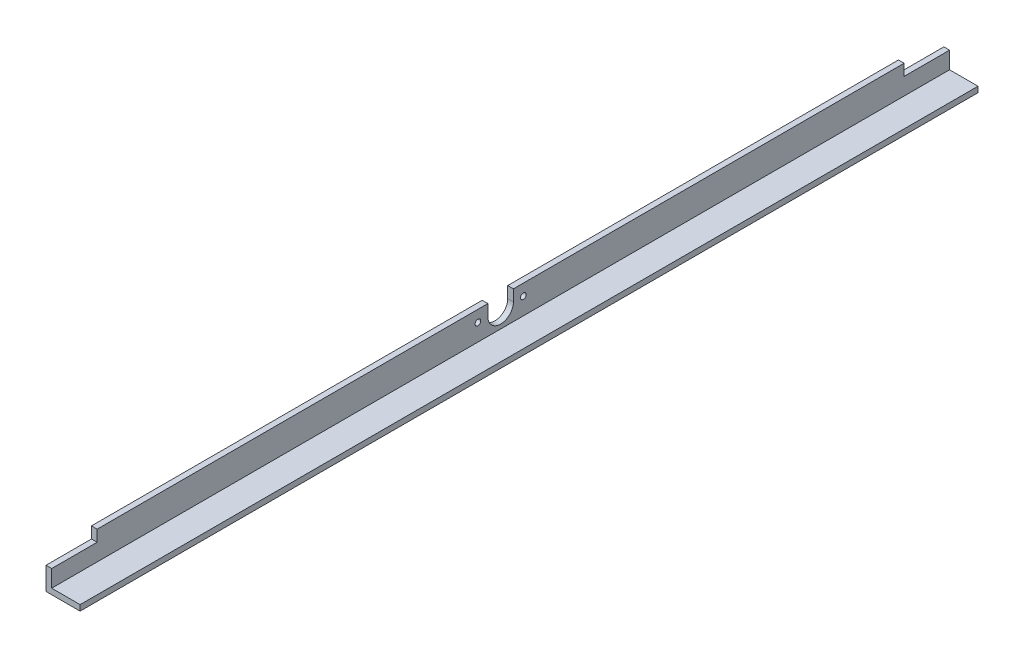
ISO-10303-21;
HEADER;
FILE_DESCRIPTION(('STEP AP214'),'2;1');
FILE_NAME('part.step','',(''),(''),'','','');
FILE_SCHEMA(('AUTOMOTIVE_DESIGN { 1 0 10303 214 1 1 1 1 }'));
ENDSEC;
DATA;
#1=APPLICATION_CONTEXT('core data for automotive mechanical design processes');
#2=APPLICATION_PROTOCOL_DEFINITION('international standard','automotive_design',2000,#1);
#3=PRODUCT_CONTEXT('',#1,'mechanical');
#4=PRODUCT('Part','Part','',(#3));
#5=PRODUCT_RELATED_PRODUCT_CATEGORY('part','',(#4));
#6=PRODUCT_DEFINITION_FORMATION('','',#4);
#7=PRODUCT_DEFINITION_CONTEXT('part definition',#1,'design');
#8=PRODUCT_DEFINITION('design','',#6,#7);
#9=PRODUCT_DEFINITION_SHAPE('','',#8);
#10=(LENGTH_UNIT() NAMED_UNIT(*) SI_UNIT(.MILLI.,.METRE.));
#11=(NAMED_UNIT(*) PLANE_ANGLE_UNIT() SI_UNIT($,.RADIAN.));
#12=(NAMED_UNIT(*) SI_UNIT($,.STERADIAN.) SOLID_ANGLE_UNIT());
#13=UNCERTAINTY_MEASURE_WITH_UNIT(LENGTH_MEASURE(1.E-05),#10,'distance_accuracy_value','');
#14=(GEOMETRIC_REPRESENTATION_CONTEXT(3) GLOBAL_UNCERTAINTY_ASSIGNED_CONTEXT((#13)) GLOBAL_UNIT_ASSIGNED_CONTEXT((#10,
#11,#12)) REPRESENTATION_CONTEXT('',''));
#15=CARTESIAN_POINT('',(0.,0.,0.));
#16=DIRECTION('',(0.,0.,1.));
#17=DIRECTION('',(1.,0.,0.));
#18=AXIS2_PLACEMENT_3D('',#15,#16,#17);
#19=CARTESIAN_POINT('',(6.35,38.1,1003.3));
#20=DIRECTION('',(-1.,0.,0.));
#21=DIRECTION('',(0.,-1.,0.));
#22=AXIS2_PLACEMENT_3D('',#19,#20,#21);
#23=PLANE('',#22);
#24=CARTESIAN_POINT('',(6.35,25.4,527.05));
#25=DIRECTION('',(1.,0.,0.));
#26=DIRECTION('',(0.,1.,0.));
#27=AXIS2_PLACEMENT_3D('',#24,#25,#26);
#28=CIRCLE('',#27,3.17500000000008);
#29=CARTESIAN_POINT('',(6.35,28.5750000000001,527.05));
#30=VERTEX_POINT('',#29);
#31=EDGE_CURVE('E287',#30,#30,#28,.T.);
#32=ORIENTED_EDGE('',*,*,#31,.F.);
#33=EDGE_LOOP('',(#32));
#34=FACE_BOUND('',#33,.T.);
#35=DIRECTION('',(0.,1.,0.));
#36=VECTOR('',#35,1.);
#37=CARTESIAN_POINT('',(6.35,38.1,0.));
#38=LINE('',#37,#36);
#39=CARTESIAN_POINT('',(6.35,6.35000000000007,0.));
#40=VERTEX_POINT('',#39);
#41=CARTESIAN_POINT('',(6.35,25.4,0.));
#42=VERTEX_POINT('',#41);
#43=EDGE_CURVE('E210',#40,#42,#38,.T.);
#44=ORIENTED_EDGE('',*,*,#43,.T.);
#45=DIRECTION('',(0.,0.,-1.));
#46=VECTOR('',#45,1.);
#47=CARTESIAN_POINT('',(6.35,25.4,0.));
#48=LINE('',#47,#46);
#49=CARTESIAN_POINT('',(6.35,25.4,50.8));
#50=VERTEX_POINT('',#49);
#51=EDGE_CURVE('E69',#50,#42,#48,.T.);
#52=ORIENTED_EDGE('',*,*,#51,.F.);
#53=DIRECTION('',(0.,-1.,0.));
#54=VECTOR('',#53,1.);
#55=CARTESIAN_POINT('',(6.35,38.1,50.8));
#56=LINE('',#55,#54);
#57=CARTESIAN_POINT('',(6.35,38.1,50.8));
#58=VERTEX_POINT('',#57);
#59=EDGE_CURVE('E316',#58,#50,#56,.T.);
#60=ORIENTED_EDGE('',*,*,#59,.F.);
#61=DIRECTION('',(0.,0.,-1.));
#62=VECTOR('',#61,1.);
#63=CARTESIAN_POINT('',(6.35,38.1,1003.3));
#64=LINE('',#63,#62);
#65=CARTESIAN_POINT('',(6.35,38.1,487.3625));
#66=VERTEX_POINT('',#65);
#67=EDGE_CURVE('E167',#66,#58,#64,.T.);
#68=ORIENTED_EDGE('',*,*,#67,.F.);
#69=DIRECTION('',(0.,1.,0.));
#70=VECTOR('',#69,1.);
#71=CARTESIAN_POINT('',(6.35,0.,487.3625));
#72=LINE('',#71,#70);
#73=CARTESIAN_POINT('',(6.35,25.4,487.3625));
#74=VERTEX_POINT('',#73);
#75=EDGE_CURVE('E257',#74,#66,#72,.T.);
#76=ORIENTED_EDGE('',*,*,#75,.F.);
#77=CARTESIAN_POINT('',(6.35,25.4,501.65));
#78=DIRECTION('',(1.,0.,0.));
#79=DIRECTION('',(0.,1.,0.));
#80=AXIS2_PLACEMENT_3D('',#77,#78,#79);
#81=CIRCLE('',#80,14.2875);
#82=CARTESIAN_POINT('',(6.35,25.4,515.9375));
#83=VERTEX_POINT('',#82);
#84=EDGE_CURVE('E269',#83,#74,#81,.T.);
#85=ORIENTED_EDGE('',*,*,#84,.F.);
#86=DIRECTION('',(0.,1.,0.));
#87=VECTOR('',#86,1.);
#88=CARTESIAN_POINT('',(6.35,0.,515.9375));
#89=LINE('',#88,#87);
#90=CARTESIAN_POINT('',(6.35,38.1,515.9375));
#91=VERTEX_POINT('',#90);
#92=EDGE_CURVE('E274',#83,#91,#89,.T.);
#93=ORIENTED_EDGE('',*,*,#92,.T.);
#94=CARTESIAN_POINT('',(6.35,38.1,952.5));
#95=VERTEX_POINT('',#94);
#96=EDGE_CURVE('E186',#95,#91,#64,.T.);
#97=ORIENTED_EDGE('',*,*,#96,.F.);
#98=DIRECTION('',(0.,1.,0.));
#99=VECTOR('',#98,1.);
#100=CARTESIAN_POINT('',(6.35,38.1,952.5));
#101=LINE('',#100,#99);
#102=CARTESIAN_POINT('',(6.35,25.4,952.5));
#103=VERTEX_POINT('',#102);
#104=EDGE_CURVE('E306',#103,#95,#101,.T.);
#105=ORIENTED_EDGE('',*,*,#104,.F.);
#106=DIRECTION('',(0.,0.,-1.));
#107=VECTOR('',#106,1.);
#108=CARTESIAN_POINT('',(6.35,25.4,1003.3));
#109=LINE('',#108,#107);
#110=CARTESIAN_POINT('',(6.35,25.4,1003.3));
#111=VERTEX_POINT('',#110);
#112=EDGE_CURVE('E312',#111,#103,#109,.T.);
#113=ORIENTED_EDGE('',*,*,#112,.F.);
#114=DIRECTION('',(0.,1.,0.));
#115=VECTOR('',#114,1.);
#116=CARTESIAN_POINT('',(6.35,38.1,1003.3));
#117=LINE('',#116,#115);
#118=CARTESIAN_POINT('',(6.35,6.35000000000007,1003.3));
#119=VERTEX_POINT('',#118);
#120=EDGE_CURVE('E238',#119,#111,#117,.T.);
#121=ORIENTED_EDGE('',*,*,#120,.F.);
#122=DIRECTION('',(0.,0.,-1.));
#123=VECTOR('',#122,1.);
#124=CARTESIAN_POINT('',(6.35,6.35000000000007,1003.3));
#125=LINE('',#124,#123);
#126=EDGE_CURVE('E189',#119,#40,#125,.T.);
#127=ORIENTED_EDGE('',*,*,#126,.T.);
#128=EDGE_LOOP('',(#44,#52,#60,#68,#76,#85,#93,#97,#105,#113,#121,#127));
#129=FACE_BOUND('',#128,.T.);
#130=CARTESIAN_POINT('',(6.35,25.4,476.25));
#131=DIRECTION('',(-1.,0.,0.));
#132=DIRECTION('',(0.,-1.,0.));
#133=AXIS2_PLACEMENT_3D('',#130,#131,#132);
#134=CIRCLE('',#133,3.17500000000008);
#135=CARTESIAN_POINT('',(6.35,22.2249999999999,476.25));
#136=VERTEX_POINT('',#135);
#137=EDGE_CURVE('E288',#136,#136,#134,.T.);
#138=ORIENTED_EDGE('',*,*,#137,.T.);
#139=EDGE_LOOP('',(#138));
#140=FACE_BOUND('',#139,.T.);
#141=ADVANCED_FACE('F45',(#34,#129,#140),#23,.F.);
#142=CARTESIAN_POINT('',(0.,38.1,1003.3));
#143=DIRECTION('',(0.,-1.,0.));
#144=DIRECTION('',(0.,0.,-1.));
#145=AXIS2_PLACEMENT_3D('',#142,#143,#144);
#146=PLANE('',#145);
#147=DIRECTION('',(0.,0.,-1.));
#148=VECTOR('',#147,1.);
#149=CARTESIAN_POINT('',(0.,38.1,1003.3));
#150=LINE('',#149,#148);
#151=CARTESIAN_POINT('',(0.,38.1,952.5));
#152=VERTEX_POINT('',#151);
#153=CARTESIAN_POINT('',(0.,38.1,515.9375));
#154=VERTEX_POINT('',#153);
#155=EDGE_CURVE('E176',#152,#154,#150,.T.);
#156=ORIENTED_EDGE('',*,*,#155,.F.);
#157=DIRECTION('',(1.,0.,0.));
#158=VECTOR('',#157,1.);
#159=CARTESIAN_POINT('',(0.,38.1,952.5));
#160=LINE('',#159,#158);
#161=EDGE_CURVE('E319',#152,#95,#160,.T.);
#162=ORIENTED_EDGE('',*,*,#161,.T.);
#163=ORIENTED_EDGE('',*,*,#96,.T.);
#164=DIRECTION('',(1.,0.,0.));
#165=VECTOR('',#164,1.);
#166=CARTESIAN_POINT('',(-0.00100000000000447,38.1,515.9375));
#167=LINE('',#166,#165);
#168=EDGE_CURVE('E261',#154,#91,#167,.T.);
#169=ORIENTED_EDGE('',*,*,#168,.F.);
#170=EDGE_LOOP('',(#156,#162,#163,#169));
#171=FACE_BOUND('',#170,.T.);
#172=ADVANCED_FACE('F349',(#171),#146,.F.);
#173=CARTESIAN_POINT('',(0.,0.,1003.3));
#174=DIRECTION('',(1.,0.,0.));
#175=DIRECTION('',(0.,0.,-1.));
#176=AXIS2_PLACEMENT_3D('',#173,#174,#175);
#177=PLANE('',#176);
#178=CARTESIAN_POINT('',(0.,25.4,527.05));
#179=DIRECTION('',(1.,0.,0.));
#180=DIRECTION('',(0.,0.,-1.));
#181=AXIS2_PLACEMENT_3D('',#178,#179,#180);
#182=CIRCLE('',#181,3.17500000000008);
#183=CARTESIAN_POINT('',(0.,25.4,523.875));
#184=VERTEX_POINT('',#183);
#185=EDGE_CURVE('E297',#184,#184,#182,.F.);
#186=ORIENTED_EDGE('',*,*,#185,.F.);
#187=EDGE_LOOP('',(#186));
#188=FACE_BOUND('',#187,.T.);
#189=DIRECTION('',(0.,-1.,0.));
#190=VECTOR('',#189,1.);
#191=CARTESIAN_POINT('',(0.,38.1,50.8));
#192=LINE('',#191,#190);
#193=CARTESIAN_POINT('',(0.,38.1,50.8));
#194=VERTEX_POINT('',#193);
#195=CARTESIAN_POINT('',(0.,25.4,50.8));
#196=VERTEX_POINT('',#195);
#197=EDGE_CURVE('E146',#194,#196,#192,.T.);
#198=ORIENTED_EDGE('',*,*,#197,.T.);
#199=DIRECTION('',(0.,0.,-1.));
#200=VECTOR('',#199,1.);
#201=CARTESIAN_POINT('',(0.,25.4,0.));
#202=LINE('',#201,#200);
#203=CARTESIAN_POINT('',(0.,25.4,0.));
#204=VERTEX_POINT('',#203);
#205=EDGE_CURVE('E158',#196,#204,#202,.T.);
#206=ORIENTED_EDGE('',*,*,#205,.T.);
#207=DIRECTION('',(0.,-1.,0.));
#208=VECTOR('',#207,1.);
#209=CARTESIAN_POINT('',(0.,0.,0.));
#210=LINE('',#209,#208);
#211=CARTESIAN_POINT('',(0.,0.,0.));
#212=VERTEX_POINT('',#211);
#213=EDGE_CURVE('E215',#204,#212,#210,.T.);
#214=ORIENTED_EDGE('',*,*,#213,.T.);
#215=DIRECTION('',(0.,0.,-1.));
#216=VECTOR('',#215,1.);
#217=CARTESIAN_POINT('',(0.,0.,1003.3));
#218=LINE('',#217,#216);
#219=CARTESIAN_POINT('',(0.,0.,1003.3));
#220=VERTEX_POINT('',#219);
#221=EDGE_CURVE('E177',#220,#212,#218,.T.);
#222=ORIENTED_EDGE('',*,*,#221,.F.);
#223=DIRECTION('',(0.,-1.,0.));
#224=VECTOR('',#223,1.);
#225=CARTESIAN_POINT('',(0.,0.,1003.3));
#226=LINE('',#225,#224);
#227=CARTESIAN_POINT('',(0.,25.4,1003.3));
#228=VERTEX_POINT('',#227);
#229=EDGE_CURVE('E182',#228,#220,#226,.T.);
#230=ORIENTED_EDGE('',*,*,#229,.F.);
#231=DIRECTION('',(0.,0.,-1.));
#232=VECTOR('',#231,1.);
#233=CARTESIAN_POINT('',(0.,25.4,1003.3));
#234=LINE('',#233,#232);
#235=CARTESIAN_POINT('',(0.,25.4,952.5));
#236=VERTEX_POINT('',#235);
#237=EDGE_CURVE('E61',#228,#236,#234,.T.);
#238=ORIENTED_EDGE('',*,*,#237,.T.);
#239=DIRECTION('',(0.,1.,0.));
#240=VECTOR('',#239,1.);
#241=CARTESIAN_POINT('',(0.,38.1,952.5));
#242=LINE('',#241,#240);
#243=EDGE_CURVE('E307',#236,#152,#242,.T.);
#244=ORIENTED_EDGE('',*,*,#243,.T.);
#245=ORIENTED_EDGE('',*,*,#155,.T.);
#246=DIRECTION('',(0.,-1.,0.));
#247=VECTOR('',#246,1.);
#248=CARTESIAN_POINT('',(0.,0.,515.9375));
#249=LINE('',#248,#247);
#250=CARTESIAN_POINT('',(0.,25.4,515.9375));
#251=VERTEX_POINT('',#250);
#252=EDGE_CURVE('E233',#154,#251,#249,.T.);
#253=ORIENTED_EDGE('',*,*,#252,.T.);
#254=CARTESIAN_POINT('',(0.,25.4,501.65));
#255=DIRECTION('',(1.,0.,0.));
#256=DIRECTION('',(0.,0.,-1.));
#257=AXIS2_PLACEMENT_3D('',#254,#255,#256);
#258=CIRCLE('',#257,14.2875);
#259=CARTESIAN_POINT('',(0.,25.4,487.3625));
#260=VERTEX_POINT('',#259);
#261=EDGE_CURVE('E283',#260,#251,#258,.F.);
#262=ORIENTED_EDGE('',*,*,#261,.F.);
#263=DIRECTION('',(0.,-1.,0.));
#264=VECTOR('',#263,1.);
#265=CARTESIAN_POINT('',(0.,0.,487.3625));
#266=LINE('',#265,#264);
#267=CARTESIAN_POINT('',(0.,38.1,487.3625));
#268=VERTEX_POINT('',#267);
#269=EDGE_CURVE('E174',#268,#260,#266,.T.);
#270=ORIENTED_EDGE('',*,*,#269,.F.);
#271=EDGE_CURVE('E165',#268,#194,#150,.T.);
#272=ORIENTED_EDGE('',*,*,#271,.T.);
#273=EDGE_LOOP('',(#198,#206,#214,#222,#230,#238,#244,#245,#253,#262,#270,#272));
#274=FACE_BOUND('',#273,.T.);
#275=CARTESIAN_POINT('',(0.,25.4,476.25));
#276=DIRECTION('',(1.,0.,0.));
#277=DIRECTION('',(0.,0.,-1.));
#278=AXIS2_PLACEMENT_3D('',#275,#276,#277);
#279=CIRCLE('',#278,3.17500000000008);
#280=CARTESIAN_POINT('',(0.,25.4,473.075));
#281=VERTEX_POINT('',#280);
#282=EDGE_CURVE('E292',#281,#281,#279,.T.);
#283=ORIENTED_EDGE('',*,*,#282,.T.);
#284=EDGE_LOOP('',(#283));
#285=FACE_BOUND('',#284,.T.);
#286=ADVANCED_FACE('F171',(#188,#274,#285),#177,.F.);
#287=CARTESIAN_POINT('',(0.,0.,1003.3));
#288=DIRECTION('',(0.,1.,0.));
#289=DIRECTION('',(-1.,0.,0.));
#290=AXIS2_PLACEMENT_3D('',#287,#288,#289);
#291=PLANE('',#290);
#292=DIRECTION('',(1.,0.,0.));
#293=VECTOR('',#292,1.);
#294=CARTESIAN_POINT('',(0.,0.,0.));
#295=LINE('',#294,#293);
#296=CARTESIAN_POINT('',(38.1,4.16333634234434E-13,0.));
#297=VERTEX_POINT('',#296);
#298=EDGE_CURVE('E217',#212,#297,#295,.T.);
#299=ORIENTED_EDGE('',*,*,#298,.T.);
#300=DIRECTION('',(0.,0.,-1.));
#301=VECTOR('',#300,1.);
#302=CARTESIAN_POINT('',(38.1,4.16333634234434E-13,1003.3));
#303=LINE('',#302,#301);
#304=CARTESIAN_POINT('',(38.1,4.16333634234434E-13,1003.3));
#305=VERTEX_POINT('',#304);
#306=EDGE_CURVE('E11',#305,#297,#303,.T.);
#307=ORIENTED_EDGE('',*,*,#306,.F.);
#308=DIRECTION('',(1.,0.,0.));
#309=VECTOR('',#308,1.);
#310=CARTESIAN_POINT('',(0.,0.,1003.3));
#311=LINE('',#310,#309);
#312=EDGE_CURVE('E221',#220,#305,#311,.T.);
#313=ORIENTED_EDGE('',*,*,#312,.F.);
#314=ORIENTED_EDGE('',*,*,#221,.T.);
#315=EDGE_LOOP('',(#299,#307,#313,#314));
#316=FACE_BOUND('',#315,.T.);
#317=ADVANCED_FACE('F47',(#316),#291,.F.);
#318=CARTESIAN_POINT('',(38.1,4.16333634234434E-13,1003.3));
#319=DIRECTION('',(-1.,0.,0.));
#320=DIRECTION('',(0.,-1.,0.));
#321=AXIS2_PLACEMENT_3D('',#318,#319,#320);
#322=PLANE('',#321);
#323=DIRECTION('',(0.,1.,0.));
#324=VECTOR('',#323,1.);
#325=CARTESIAN_POINT('',(38.1,4.16333634234434E-13,0.));
#326=LINE('',#325,#324);
#327=CARTESIAN_POINT('',(38.0999999999999,6.35000000000041,0.));
#328=VERTEX_POINT('',#327);
#329=EDGE_CURVE('E208',#297,#328,#326,.T.);
#330=ORIENTED_EDGE('',*,*,#329,.T.);
#331=DIRECTION('',(0.,0.,-1.));
#332=VECTOR('',#331,1.);
#333=CARTESIAN_POINT('',(38.0999999999999,6.35000000000041,1003.3));
#334=LINE('',#333,#332);
#335=CARTESIAN_POINT('',(38.0999999999999,6.35000000000041,1003.3));
#336=VERTEX_POINT('',#335);
#337=EDGE_CURVE('E54',#336,#328,#334,.T.);
#338=ORIENTED_EDGE('',*,*,#337,.F.);
#339=DIRECTION('',(0.,1.,0.));
#340=VECTOR('',#339,1.);
#341=CARTESIAN_POINT('',(38.1,4.16333634234434E-13,1003.3));
#342=LINE('',#341,#340);
#343=EDGE_CURVE('E225',#305,#336,#342,.T.);
#344=ORIENTED_EDGE('',*,*,#343,.F.);
#345=ORIENTED_EDGE('',*,*,#306,.T.);
#346=EDGE_LOOP('',(#330,#338,#344,#345));
#347=FACE_BOUND('',#346,.T.);
#348=ADVANCED_FACE('F344',(#347),#322,.F.);
#349=CARTESIAN_POINT('',(38.0999999999999,6.35000000000041,1003.3));
#350=DIRECTION('',(0.,-1.,0.));
#351=DIRECTION('',(1.,0.,0.));
#352=AXIS2_PLACEMENT_3D('',#349,#350,#351);
#353=PLANE('',#352);
#354=DIRECTION('',(-1.,0.,0.));
#355=VECTOR('',#354,1.);
#356=CARTESIAN_POINT('',(38.0999999999999,6.35000000000041,0.));
#357=LINE('',#356,#355);
#358=EDGE_CURVE('E200',#328,#40,#357,.T.);
#359=ORIENTED_EDGE('',*,*,#358,.T.);
#360=ORIENTED_EDGE('',*,*,#126,.F.);
#361=DIRECTION('',(-1.,0.,0.));
#362=VECTOR('',#361,1.);
#363=CARTESIAN_POINT('',(38.0999999999999,6.35000000000041,1003.3));
#364=LINE('',#363,#362);
#365=EDGE_CURVE('E201',#336,#119,#364,.T.);
#366=ORIENTED_EDGE('',*,*,#365,.F.);
#367=ORIENTED_EDGE('',*,*,#337,.T.);
#368=EDGE_LOOP('',(#359,#360,#366,#367));
#369=FACE_BOUND('',#368,.T.);
#370=ADVANCED_FACE('F198',(#369),#353,.F.);
#371=ORIENTED_EDGE('',*,*,#67,.T.);
#372=DIRECTION('',(1.,0.,0.));
#373=VECTOR('',#372,1.);
#374=CARTESIAN_POINT('',(0.,38.1,50.8));
#375=LINE('',#374,#373);
#376=EDGE_CURVE('E150',#194,#58,#375,.T.);
#377=ORIENTED_EDGE('',*,*,#376,.F.);
#378=ORIENTED_EDGE('',*,*,#271,.F.);
#379=DIRECTION('',(1.,0.,0.));
#380=VECTOR('',#379,1.);
#381=CARTESIAN_POINT('',(-0.00100000000000447,38.1,487.3625));
#382=LINE('',#381,#380);
#383=EDGE_CURVE('E248',#268,#66,#382,.T.);
#384=ORIENTED_EDGE('',*,*,#383,.T.);
#385=EDGE_LOOP('',(#371,#377,#378,#384));
#386=FACE_BOUND('',#385,.T.);
#387=ADVANCED_FACE('F163',(#386),#146,.F.);
#388=CARTESIAN_POINT('',(0.,0.,1003.3));
#389=DIRECTION('',(0.,0.,1.));
#390=DIRECTION('',(1.,0.,0.));
#391=AXIS2_PLACEMENT_3D('',#388,#389,#390);
#392=PLANE('',#391);
#393=DIRECTION('',(1.,0.,0.));
#394=VECTOR('',#393,1.);
#395=CARTESIAN_POINT('',(0.,25.4,1003.3));
#396=LINE('',#395,#394);
#397=EDGE_CURVE('E311',#228,#111,#396,.T.);
#398=ORIENTED_EDGE('',*,*,#397,.F.);
#399=ORIENTED_EDGE('',*,*,#229,.T.);
#400=ORIENTED_EDGE('',*,*,#312,.T.);
#401=ORIENTED_EDGE('',*,*,#343,.T.);
#402=ORIENTED_EDGE('',*,*,#365,.T.);
#403=ORIENTED_EDGE('',*,*,#120,.T.);
#404=EDGE_LOOP('',(#398,#399,#400,#401,#402,#403));
#405=FACE_BOUND('',#404,.T.);
#406=ADVANCED_FACE('F342',(#405),#392,.T.);
#407=CARTESIAN_POINT('',(0.,0.,0.));
#408=DIRECTION('',(0.,0.,1.));
#409=DIRECTION('',(1.,0.,0.));
#410=AXIS2_PLACEMENT_3D('',#407,#408,#409);
#411=PLANE('',#410);
#412=ORIENTED_EDGE('',*,*,#213,.F.);
#413=DIRECTION('',(1.,0.,0.));
#414=VECTOR('',#413,1.);
#415=CARTESIAN_POINT('',(0.,25.4,0.));
#416=LINE('',#415,#414);
#417=EDGE_CURVE('E293',#204,#42,#416,.T.);
#418=ORIENTED_EDGE('',*,*,#417,.T.);
#419=ORIENTED_EDGE('',*,*,#43,.F.);
#420=ORIENTED_EDGE('',*,*,#358,.F.);
#421=ORIENTED_EDGE('',*,*,#329,.F.);
#422=ORIENTED_EDGE('',*,*,#298,.F.);
#423=EDGE_LOOP('',(#412,#418,#419,#420,#421,#422));
#424=FACE_BOUND('',#423,.T.);
#425=ADVANCED_FACE('F206',(#424),#411,.F.);
#426=CARTESIAN_POINT('',(-0.00100000000000013,0.,487.3625));
#427=DIRECTION('',(0.,0.,-1.));
#428=DIRECTION('',(-1.,0.,0.));
#429=AXIS2_PLACEMENT_3D('',#426,#427,#428);
#430=PLANE('',#429);
#431=ORIENTED_EDGE('',*,*,#269,.T.);
#432=DIRECTION('',(1.,0.,0.));
#433=VECTOR('',#432,1.);
#434=CARTESIAN_POINT('',(-0.00100000000000273,25.4,487.3625));
#435=LINE('',#434,#433);
#436=EDGE_CURVE('E251',#260,#74,#435,.T.);
#437=ORIENTED_EDGE('',*,*,#436,.T.);
#438=ORIENTED_EDGE('',*,*,#75,.T.);
#439=ORIENTED_EDGE('',*,*,#383,.F.);
#440=EDGE_LOOP('',(#431,#437,#438,#439));
#441=FACE_BOUND('',#440,.T.);
#442=ADVANCED_FACE('F353',(#441),#430,.F.);
#443=CARTESIAN_POINT('',(-0.00100000000000273,25.4,501.65));
#444=DIRECTION('',(1.,0.,0.));
#445=DIRECTION('',(0.,1.,0.));
#446=AXIS2_PLACEMENT_3D('',#443,#444,#445);
#447=CYLINDRICAL_SURFACE('',#446,14.2875);
#448=ORIENTED_EDGE('',*,*,#261,.T.);
#449=DIRECTION('',(1.,0.,0.));
#450=VECTOR('',#449,1.);
#451=CARTESIAN_POINT('',(-0.00100000000000273,25.4,515.9375));
#452=LINE('',#451,#450);
#453=EDGE_CURVE('E254',#251,#83,#452,.T.);
#454=ORIENTED_EDGE('',*,*,#453,.T.);
#455=ORIENTED_EDGE('',*,*,#84,.T.);
#456=ORIENTED_EDGE('',*,*,#436,.F.);
#457=EDGE_LOOP('',(#448,#454,#455,#456));
#458=FACE_BOUND('',#457,.T.);
#459=ADVANCED_FACE('F352',(#458),#447,.F.);
#460=CARTESIAN_POINT('',(-0.00100000000000013,0.,515.9375));
#461=DIRECTION('',(0.,0.,-1.));
#462=DIRECTION('',(-1.,0.,0.));
#463=AXIS2_PLACEMENT_3D('',#460,#461,#462);
#464=PLANE('',#463);
#465=ORIENTED_EDGE('',*,*,#168,.T.);
#466=ORIENTED_EDGE('',*,*,#92,.F.);
#467=ORIENTED_EDGE('',*,*,#453,.F.);
#468=ORIENTED_EDGE('',*,*,#252,.F.);
#469=EDGE_LOOP('',(#465,#466,#467,#468));
#470=FACE_BOUND('',#469,.T.);
#471=ADVANCED_FACE('F351',(#470),#464,.T.);
#472=CARTESIAN_POINT('',(-0.00100000000000273,25.4,527.05));
#473=DIRECTION('',(1.,0.,0.));
#474=DIRECTION('',(0.,1.,0.));
#475=AXIS2_PLACEMENT_3D('',#472,#473,#474);
#476=CYLINDRICAL_SURFACE('',#475,3.17500000000008);
#477=ORIENTED_EDGE('',*,*,#31,.T.);
#478=EDGE_LOOP('',(#477));
#479=FACE_BOUND('',#478,.T.);
#480=ORIENTED_EDGE('',*,*,#185,.T.);
#481=EDGE_LOOP('',(#480));
#482=FACE_BOUND('',#481,.T.);
#483=ADVANCED_FACE('F392',(#479,#482),#476,.F.);
#484=CARTESIAN_POINT('',(-0.00100000000000273,25.4,476.25));
#485=DIRECTION('',(1.,0.,0.));
#486=DIRECTION('',(0.,1.,0.));
#487=AXIS2_PLACEMENT_3D('',#484,#485,#486);
#488=CYLINDRICAL_SURFACE('',#487,3.17500000000008);
#489=ORIENTED_EDGE('',*,*,#137,.F.);
#490=EDGE_LOOP('',(#489));
#491=FACE_BOUND('',#490,.T.);
#492=ORIENTED_EDGE('',*,*,#282,.F.);
#493=EDGE_LOOP('',(#492));
#494=FACE_BOUND('',#493,.T.);
#495=ADVANCED_FACE('F396',(#491,#494),#488,.F.);
#496=CARTESIAN_POINT('',(0.,25.4,0.));
#497=DIRECTION('',(0.,-1.,0.));
#498=DIRECTION('',(0.,0.,-1.));
#499=AXIS2_PLACEMENT_3D('',#496,#497,#498);
#500=PLANE('',#499);
#501=ORIENTED_EDGE('',*,*,#51,.T.);
#502=ORIENTED_EDGE('',*,*,#417,.F.);
#503=ORIENTED_EDGE('',*,*,#205,.F.);
#504=DIRECTION('',(1.,0.,0.));
#505=VECTOR('',#504,1.);
#506=CARTESIAN_POINT('',(0.,25.4,50.8));
#507=LINE('',#506,#505);
#508=EDGE_CURVE('E152',#196,#50,#507,.T.);
#509=ORIENTED_EDGE('',*,*,#508,.T.);
#510=EDGE_LOOP('',(#501,#502,#503,#509));
#511=FACE_BOUND('',#510,.T.);
#512=ADVANCED_FACE('F402',(#511),#500,.F.);
#513=CARTESIAN_POINT('',(0.,38.1,50.8));
#514=DIRECTION('',(0.,0.,1.));
#515=DIRECTION('',(0.,-1.,0.));
#516=AXIS2_PLACEMENT_3D('',#513,#514,#515);
#517=PLANE('',#516);
#518=ORIENTED_EDGE('',*,*,#59,.T.);
#519=ORIENTED_EDGE('',*,*,#508,.F.);
#520=ORIENTED_EDGE('',*,*,#197,.F.);
#521=ORIENTED_EDGE('',*,*,#376,.T.);
#522=EDGE_LOOP('',(#518,#519,#520,#521));
#523=FACE_BOUND('',#522,.T.);
#524=ADVANCED_FACE('F149',(#523),#517,.F.);
#525=CARTESIAN_POINT('',(0.,38.1,952.5));
#526=DIRECTION('',(0.,0.,-1.));
#527=DIRECTION('',(0.,1.,0.));
#528=AXIS2_PLACEMENT_3D('',#525,#526,#527);
#529=PLANE('',#528);
#530=ORIENTED_EDGE('',*,*,#104,.T.);
#531=ORIENTED_EDGE('',*,*,#161,.F.);
#532=ORIENTED_EDGE('',*,*,#243,.F.);
#533=DIRECTION('',(1.,0.,0.));
#534=VECTOR('',#533,1.);
#535=CARTESIAN_POINT('',(0.,25.4,952.5));
#536=LINE('',#535,#534);
#537=EDGE_CURVE('E323',#236,#103,#536,.T.);
#538=ORIENTED_EDGE('',*,*,#537,.T.);
#539=EDGE_LOOP('',(#530,#531,#532,#538));
#540=FACE_BOUND('',#539,.T.);
#541=ADVANCED_FACE('F406',(#540),#529,.F.);
#542=CARTESIAN_POINT('',(0.,25.4,1003.3));
#543=DIRECTION('',(0.,-1.,0.));
#544=DIRECTION('',(0.,0.,-1.));
#545=AXIS2_PLACEMENT_3D('',#542,#543,#544);
#546=PLANE('',#545);
#547=ORIENTED_EDGE('',*,*,#112,.T.);
#548=ORIENTED_EDGE('',*,*,#537,.F.);
#549=ORIENTED_EDGE('',*,*,#237,.F.);
#550=ORIENTED_EDGE('',*,*,#397,.T.);
#551=EDGE_LOOP('',(#547,#548,#549,#550));
#552=FACE_BOUND('',#551,.T.);
#553=ADVANCED_FACE('F409',(#552),#546,.F.);
#554=CLOSED_SHELL('',(#141,#172,#286,#317,#348,#370,#387,#406,#425,#442,#459,#471,#483,#495,
#512,#524,#541,#553));
#555=MANIFOLD_SOLID_BREP('B2',#554);
#556=ADVANCED_BREP_SHAPE_REPRESENTATION('',(#18,#555),#14);
#557=SHAPE_DEFINITION_REPRESENTATION(#9,#556);
ENDSEC;
END-ISO-10303-21;
